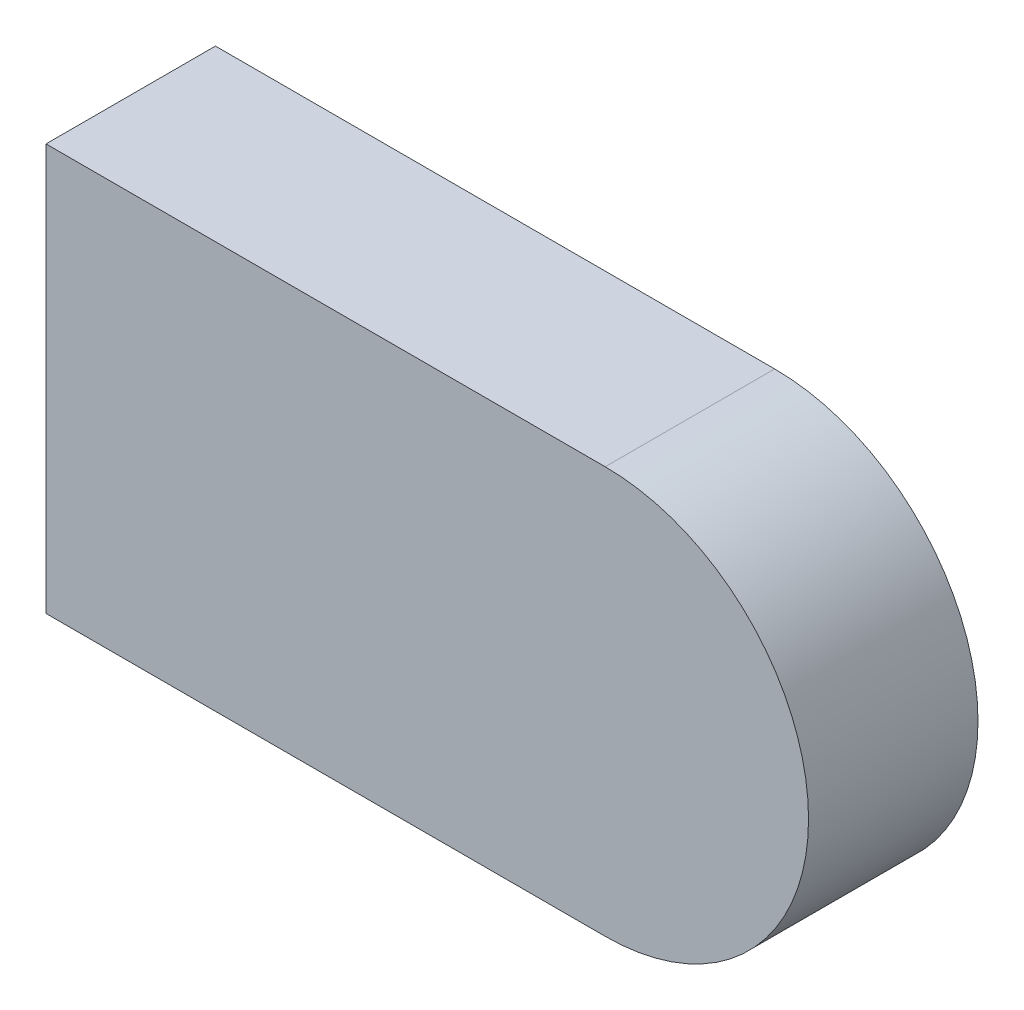
ISO-10303-21;
HEADER;
FILE_DESCRIPTION(('STEP AP214'),'2;1');
FILE_NAME('part.step','',(''),(''),'','','');
FILE_SCHEMA(('AUTOMOTIVE_DESIGN { 1 0 10303 214 1 1 1 1 }'));
ENDSEC;
DATA;
#1=APPLICATION_CONTEXT('core data for automotive mechanical design processes');
#2=APPLICATION_PROTOCOL_DEFINITION('international standard','automotive_design',2000,#1);
#3=PRODUCT_CONTEXT('',#1,'mechanical');
#4=PRODUCT('Part','Part','',(#3));
#5=PRODUCT_RELATED_PRODUCT_CATEGORY('part','',(#4));
#6=PRODUCT_DEFINITION_FORMATION('','',#4);
#7=PRODUCT_DEFINITION_CONTEXT('part definition',#1,'design');
#8=PRODUCT_DEFINITION('design','',#6,#7);
#9=PRODUCT_DEFINITION_SHAPE('','',#8);
#10=(LENGTH_UNIT() NAMED_UNIT(*) SI_UNIT(.MILLI.,.METRE.));
#11=(NAMED_UNIT(*) PLANE_ANGLE_UNIT() SI_UNIT($,.RADIAN.));
#12=(NAMED_UNIT(*) SI_UNIT($,.STERADIAN.) SOLID_ANGLE_UNIT());
#13=UNCERTAINTY_MEASURE_WITH_UNIT(LENGTH_MEASURE(1.E-05),#10,'distance_accuracy_value','');
#14=(GEOMETRIC_REPRESENTATION_CONTEXT(3) GLOBAL_UNCERTAINTY_ASSIGNED_CONTEXT((#13)) GLOBAL_UNIT_ASSIGNED_CONTEXT((#10,
#11,#12)) REPRESENTATION_CONTEXT('',''));
#15=CARTESIAN_POINT('',(0.,0.,0.));
#16=DIRECTION('',(0.,0.,1.));
#17=DIRECTION('',(1.,0.,0.));
#18=AXIS2_PLACEMENT_3D('',#15,#16,#17);
#19=CARTESIAN_POINT('',(-4.05,-0.87,0.));
#20=DIRECTION('',(0.,1.,0.));
#21=DIRECTION('',(1.,0.,0.));
#22=AXIS2_PLACEMENT_3D('',#19,#20,#21);
#23=PLANE('',#22);
#24=DIRECTION('',(1.,0.,0.));
#25=VECTOR('',#24,1.);
#26=CARTESIAN_POINT('',(-4.05,-0.87,0.));
#27=LINE('',#26,#25);
#28=CARTESIAN_POINT('',(-4.05,-0.87,0.));
#29=VERTEX_POINT('',#28);
#30=CARTESIAN_POINT('',(-3.72,-0.87,0.));
#31=VERTEX_POINT('',#30);
#32=EDGE_CURVE('E11',#29,#31,#27,.T.);
#33=ORIENTED_EDGE('',*,*,#32,.T.);
#34=DIRECTION('',(0.,0.,1.));
#35=VECTOR('',#34,1.);
#36=CARTESIAN_POINT('',(-3.72,-0.87,0.));
#37=LINE('',#36,#35);
#38=CARTESIAN_POINT('',(-3.72,-0.87,0.1));
#39=VERTEX_POINT('',#38);
#40=EDGE_CURVE('E24',#31,#39,#37,.T.);
#41=ORIENTED_EDGE('',*,*,#40,.T.);
#42=DIRECTION('',(1.,0.,0.));
#43=VECTOR('',#42,1.);
#44=CARTESIAN_POINT('',(-4.05,-0.87,0.1));
#45=LINE('',#44,#43);
#46=CARTESIAN_POINT('',(-4.05,-0.87,0.1));
#47=VERTEX_POINT('',#46);
#48=EDGE_CURVE('E88',#47,#39,#45,.T.);
#49=ORIENTED_EDGE('',*,*,#48,.F.);
#50=DIRECTION('',(0.,0.,1.));
#51=VECTOR('',#50,1.);
#52=CARTESIAN_POINT('',(-4.05,-0.87,0.));
#53=LINE('',#52,#51);
#54=EDGE_CURVE('E36',#29,#47,#53,.T.);
#55=ORIENTED_EDGE('',*,*,#54,.F.);
#56=EDGE_LOOP('',(#33,#41,#49,#55));
#57=FACE_BOUND('',#56,.T.);
#58=ADVANCED_FACE('F17',(#57),#23,.F.);
#59=CARTESIAN_POINT('',(-3.72,-0.75,0.));
#60=DIRECTION('',(0.,0.,-1.));
#61=DIRECTION('',(1.,0.,0.));
#62=AXIS2_PLACEMENT_3D('',#59,#60,#61);
#63=CYLINDRICAL_SURFACE('',#62,0.12);
#64=CARTESIAN_POINT('',(-3.72,-0.75,0.));
#65=DIRECTION('',(0.,0.,1.));
#66=DIRECTION('',(1.,0.,0.));
#67=AXIS2_PLACEMENT_3D('',#64,#65,#66);
#68=CIRCLE('',#67,0.12);
#69=CARTESIAN_POINT('',(-3.72,-0.63,0.));
#70=VERTEX_POINT('',#69);
#71=EDGE_CURVE('E85',#31,#70,#68,.T.);
#72=ORIENTED_EDGE('',*,*,#71,.T.);
#73=DIRECTION('',(0.,0.,1.));
#74=VECTOR('',#73,1.);
#75=CARTESIAN_POINT('',(-3.72,-0.63,0.));
#76=LINE('',#75,#74);
#77=CARTESIAN_POINT('',(-3.72,-0.63,0.1));
#78=VERTEX_POINT('',#77);
#79=EDGE_CURVE('E73',#70,#78,#76,.T.);
#80=ORIENTED_EDGE('',*,*,#79,.T.);
#81=CARTESIAN_POINT('',(-3.72,-0.75,0.1));
#82=DIRECTION('',(0.,0.,1.));
#83=DIRECTION('',(1.,0.,0.));
#84=AXIS2_PLACEMENT_3D('',#81,#82,#83);
#85=CIRCLE('',#84,0.12);
#86=EDGE_CURVE('E66',#39,#78,#85,.T.);
#87=ORIENTED_EDGE('',*,*,#86,.F.);
#88=ORIENTED_EDGE('',*,*,#40,.F.);
#89=EDGE_LOOP('',(#72,#80,#87,#88));
#90=FACE_BOUND('',#89,.T.);
#91=ADVANCED_FACE('F89',(#90),#63,.T.);
#92=CARTESIAN_POINT('',(-4.05,-0.63,0.));
#93=DIRECTION('',(0.,1.,0.));
#94=DIRECTION('',(1.,0.,0.));
#95=AXIS2_PLACEMENT_3D('',#92,#93,#94);
#96=PLANE('',#95);
#97=DIRECTION('',(0.,0.,1.));
#98=VECTOR('',#97,1.);
#99=CARTESIAN_POINT('',(-4.05,-0.63,0.));
#100=LINE('',#99,#98);
#101=CARTESIAN_POINT('',(-4.05,-0.63,0.));
#102=VERTEX_POINT('',#101);
#103=CARTESIAN_POINT('',(-4.05,-0.63,0.1));
#104=VERTEX_POINT('',#103);
#105=EDGE_CURVE('E56',#102,#104,#100,.T.);
#106=ORIENTED_EDGE('',*,*,#105,.T.);
#107=DIRECTION('',(1.,0.,0.));
#108=VECTOR('',#107,1.);
#109=CARTESIAN_POINT('',(-4.05,-0.63,0.1));
#110=LINE('',#109,#108);
#111=EDGE_CURVE('E67',#104,#78,#110,.T.);
#112=ORIENTED_EDGE('',*,*,#111,.T.);
#113=ORIENTED_EDGE('',*,*,#79,.F.);
#114=DIRECTION('',(1.,0.,0.));
#115=VECTOR('',#114,1.);
#116=CARTESIAN_POINT('',(-4.05,-0.63,0.));
#117=LINE('',#116,#115);
#118=EDGE_CURVE('E71',#102,#70,#117,.T.);
#119=ORIENTED_EDGE('',*,*,#118,.F.);
#120=EDGE_LOOP('',(#106,#112,#113,#119));
#121=FACE_BOUND('',#120,.T.);
#122=ADVANCED_FACE('F72',(#121),#96,.T.);
#123=CARTESIAN_POINT('',(-4.05,-0.87,0.));
#124=DIRECTION('',(-1.,0.,0.));
#125=DIRECTION('',(0.,1.,0.));
#126=AXIS2_PLACEMENT_3D('',#123,#124,#125);
#127=PLANE('',#126);
#128=ORIENTED_EDGE('',*,*,#54,.T.);
#129=DIRECTION('',(0.,1.,0.));
#130=VECTOR('',#129,1.);
#131=CARTESIAN_POINT('',(-4.05,-0.87,0.1));
#132=LINE('',#131,#130);
#133=EDGE_CURVE('E62',#47,#104,#132,.T.);
#134=ORIENTED_EDGE('',*,*,#133,.T.);
#135=ORIENTED_EDGE('',*,*,#105,.F.);
#136=DIRECTION('',(0.,1.,0.));
#137=VECTOR('',#136,1.);
#138=CARTESIAN_POINT('',(-4.05,-0.87,0.));
#139=LINE('',#138,#137);
#140=EDGE_CURVE('E60',#29,#102,#139,.T.);
#141=ORIENTED_EDGE('',*,*,#140,.F.);
#142=EDGE_LOOP('',(#128,#134,#135,#141));
#143=FACE_BOUND('',#142,.T.);
#144=ADVANCED_FACE('F58',(#143),#127,.T.);
#145=CARTESIAN_POINT('',(-3.849490847913,-0.75,0.));
#146=DIRECTION('',(0.,0.,1.));
#147=DIRECTION('',(1.,0.,0.));
#148=AXIS2_PLACEMENT_3D('',#145,#146,#147);
#149=PLANE('',#148);
#150=ORIENTED_EDGE('',*,*,#140,.T.);
#151=ORIENTED_EDGE('',*,*,#118,.T.);
#152=ORIENTED_EDGE('',*,*,#71,.F.);
#153=ORIENTED_EDGE('',*,*,#32,.F.);
#154=EDGE_LOOP('',(#150,#151,#152,#153));
#155=FACE_BOUND('',#154,.T.);
#156=ADVANCED_FACE('F77',(#155),#149,.F.);
#157=CARTESIAN_POINT('',(-3.849490847913,-0.75,0.1));
#158=DIRECTION('',(0.,0.,1.));
#159=DIRECTION('',(1.,0.,0.));
#160=AXIS2_PLACEMENT_3D('',#157,#158,#159);
#161=PLANE('',#160);
#162=ORIENTED_EDGE('',*,*,#48,.T.);
#163=ORIENTED_EDGE('',*,*,#86,.T.);
#164=ORIENTED_EDGE('',*,*,#111,.F.);
#165=ORIENTED_EDGE('',*,*,#133,.F.);
#166=EDGE_LOOP('',(#162,#163,#164,#165));
#167=FACE_BOUND('',#166,.T.);
#168=ADVANCED_FACE('F91',(#167),#161,.T.);
#169=CLOSED_SHELL('',(#58,#91,#122,#144,#156,#168));
#170=MANIFOLD_SOLID_BREP('B1',#169);
#171=ADVANCED_BREP_SHAPE_REPRESENTATION('',(#18,#170),#14);
#172=SHAPE_DEFINITION_REPRESENTATION(#9,#171);
ENDSEC;
END-ISO-10303-21;
